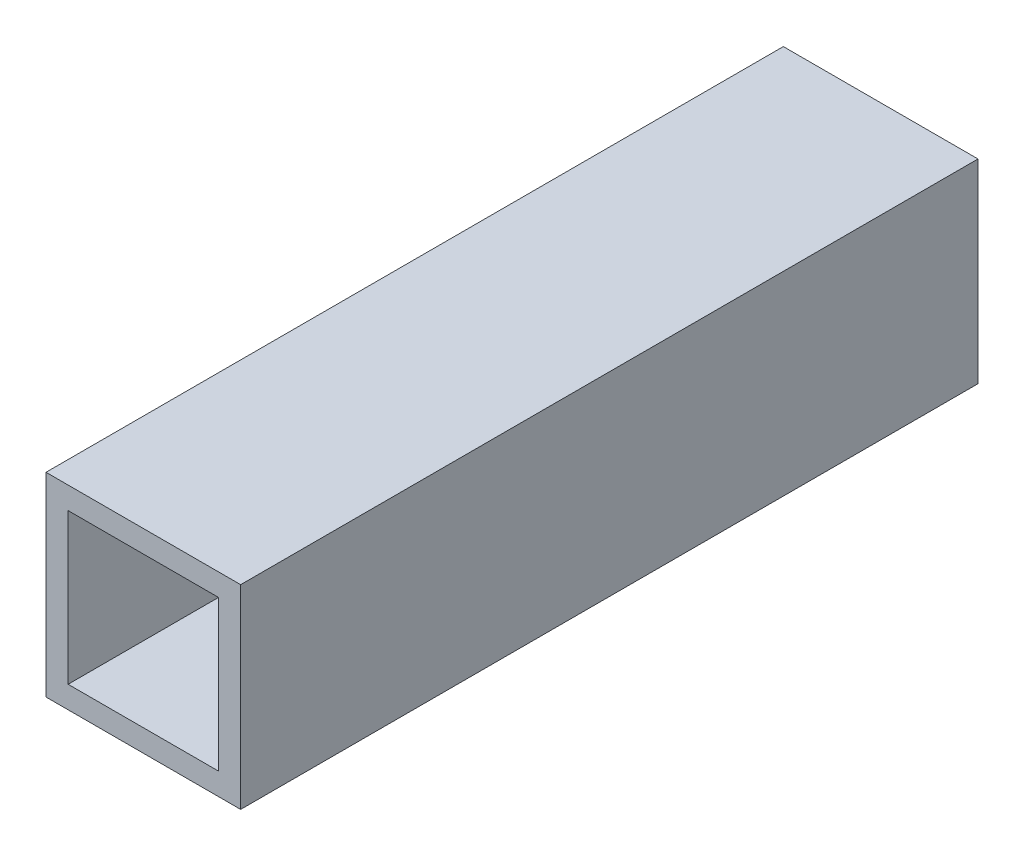
ISO-10303-21;
HEADER;
FILE_DESCRIPTION(('STEP AP214'),'2;1');
FILE_NAME('part.step','',(''),(''),'','','');
FILE_SCHEMA(('AUTOMOTIVE_DESIGN { 1 0 10303 214 1 1 1 1 }'));
ENDSEC;
DATA;
#1=APPLICATION_CONTEXT('core data for automotive mechanical design processes');
#2=APPLICATION_PROTOCOL_DEFINITION('international standard','automotive_design',2000,#1);
#3=PRODUCT_CONTEXT('',#1,'mechanical');
#4=PRODUCT('Part','Part','',(#3));
#5=PRODUCT_RELATED_PRODUCT_CATEGORY('part','',(#4));
#6=PRODUCT_DEFINITION_FORMATION('','',#4);
#7=PRODUCT_DEFINITION_CONTEXT('part definition',#1,'design');
#8=PRODUCT_DEFINITION('design','',#6,#7);
#9=PRODUCT_DEFINITION_SHAPE('','',#8);
#10=(LENGTH_UNIT() NAMED_UNIT(*) SI_UNIT(.MILLI.,.METRE.));
#11=(NAMED_UNIT(*) PLANE_ANGLE_UNIT() SI_UNIT($,.RADIAN.));
#12=(NAMED_UNIT(*) SI_UNIT($,.STERADIAN.) SOLID_ANGLE_UNIT());
#13=UNCERTAINTY_MEASURE_WITH_UNIT(LENGTH_MEASURE(1.E-05),#10,'distance_accuracy_value','');
#14=(GEOMETRIC_REPRESENTATION_CONTEXT(3) GLOBAL_UNCERTAINTY_ASSIGNED_CONTEXT((#13)) GLOBAL_UNIT_ASSIGNED_CONTEXT((#10,
#11,#12)) REPRESENTATION_CONTEXT('',''));
#15=CARTESIAN_POINT('',(0.,0.,0.));
#16=DIRECTION('',(0.,0.,1.));
#17=DIRECTION('',(1.,0.,0.));
#18=AXIS2_PLACEMENT_3D('',#15,#16,#17);
#19=CARTESIAN_POINT('',(0.,0.,50.));
#20=DIRECTION('',(0.,0.,1.));
#21=DIRECTION('',(1.,0.,0.));
#22=AXIS2_PLACEMENT_3D('',#19,#20,#21);
#23=PLANE('',#22);
#24=DIRECTION('',(0.,-1.,0.));
#25=VECTOR('',#24,1.);
#26=CARTESIAN_POINT('',(-2.3842105263158,6.33157894736842,50.));
#27=LINE('',#26,#25);
#28=CARTESIAN_POINT('',(-2.3842105263158,6.33157894736842,50.));
#29=VERTEX_POINT('',#28);
#30=CARTESIAN_POINT('',(-2.3842105263158,-6.86842105263158,50.));
#31=VERTEX_POINT('',#30);
#32=EDGE_CURVE('E136',#29,#31,#27,.T.);
#33=ORIENTED_EDGE('',*,*,#32,.T.);
#34=DIRECTION('',(1.,0.,0.));
#35=VECTOR('',#34,1.);
#36=CARTESIAN_POINT('',(-2.3842105263158,-6.86842105263158,50.));
#37=LINE('',#36,#35);
#38=CARTESIAN_POINT('',(10.8157894736842,-6.86842105263158,50.));
#39=VERTEX_POINT('',#38);
#40=EDGE_CURVE('E139',#31,#39,#37,.T.);
#41=ORIENTED_EDGE('',*,*,#40,.T.);
#42=DIRECTION('',(0.,1.,0.));
#43=VECTOR('',#42,1.);
#44=CARTESIAN_POINT('',(10.8157894736842,6.33157894736842,50.));
#45=LINE('',#44,#43);
#46=CARTESIAN_POINT('',(10.8157894736842,6.33157894736842,50.));
#47=VERTEX_POINT('',#46);
#48=EDGE_CURVE('E142',#39,#47,#45,.T.);
#49=ORIENTED_EDGE('',*,*,#48,.T.);
#50=DIRECTION('',(-1.,0.,0.));
#51=VECTOR('',#50,1.);
#52=CARTESIAN_POINT('',(-2.3842105263158,6.33157894736842,50.));
#53=LINE('',#52,#51);
#54=EDGE_CURVE('E144',#47,#29,#53,.T.);
#55=ORIENTED_EDGE('',*,*,#54,.T.);
#56=EDGE_LOOP('',(#33,#41,#49,#55));
#57=FACE_BOUND('',#56,.T.);
#58=DIRECTION('',(1.,0.,0.));
#59=VECTOR('',#58,1.);
#60=CARTESIAN_POINT('',(-0.884210526315795,-5.36842105263158,50.));
#61=LINE('',#60,#59);
#62=CARTESIAN_POINT('',(-0.884210526315795,-5.36842105263158,50.));
#63=VERTEX_POINT('',#62);
#64=CARTESIAN_POINT('',(9.3157894736842,-5.36842105263158,50.));
#65=VERTEX_POINT('',#64);
#66=EDGE_CURVE('E108',#63,#65,#61,.T.);
#67=ORIENTED_EDGE('',*,*,#66,.F.);
#68=DIRECTION('',(0.,-1.,0.));
#69=VECTOR('',#68,1.);
#70=CARTESIAN_POINT('',(-0.884210526315796,4.83157894736842,50.));
#71=LINE('',#70,#69);
#72=CARTESIAN_POINT('',(-0.884210526315796,4.83157894736842,50.));
#73=VERTEX_POINT('',#72);
#74=EDGE_CURVE('E100',#73,#63,#71,.T.);
#75=ORIENTED_EDGE('',*,*,#74,.F.);
#76=DIRECTION('',(-1.,0.,0.));
#77=VECTOR('',#76,1.);
#78=CARTESIAN_POINT('',(-0.884210526315796,4.83157894736842,50.));
#79=LINE('',#78,#77);
#80=CARTESIAN_POINT('',(9.3157894736842,4.83157894736842,50.));
#81=VERTEX_POINT('',#80);
#82=EDGE_CURVE('E122',#81,#73,#79,.T.);
#83=ORIENTED_EDGE('',*,*,#82,.F.);
#84=DIRECTION('',(0.,1.,0.));
#85=VECTOR('',#84,1.);
#86=CARTESIAN_POINT('',(9.3157894736842,4.83157894736842,50.));
#87=LINE('',#86,#85);
#88=EDGE_CURVE('E120',#65,#81,#87,.T.);
#89=ORIENTED_EDGE('',*,*,#88,.F.);
#90=EDGE_LOOP('',(#67,#75,#83,#89));
#91=FACE_BOUND('',#90,.T.);
#92=ADVANCED_FACE('F35',(#57,#91),#23,.T.);
#93=CARTESIAN_POINT('',(0.,0.,0.));
#94=DIRECTION('',(0.,0.,1.));
#95=DIRECTION('',(1.,0.,0.));
#96=AXIS2_PLACEMENT_3D('',#93,#94,#95);
#97=PLANE('',#96);
#98=DIRECTION('',(0.,-1.,0.));
#99=VECTOR('',#98,1.);
#100=CARTESIAN_POINT('',(-2.3842105263158,6.33157894736842,0.));
#101=LINE('',#100,#99);
#102=CARTESIAN_POINT('',(-2.3842105263158,6.33157894736842,0.));
#103=VERTEX_POINT('',#102);
#104=CARTESIAN_POINT('',(-2.3842105263158,-6.86842105263158,0.));
#105=VERTEX_POINT('',#104);
#106=EDGE_CURVE('E116',#103,#105,#101,.T.);
#107=ORIENTED_EDGE('',*,*,#106,.F.);
#108=DIRECTION('',(-1.,0.,0.));
#109=VECTOR('',#108,1.);
#110=CARTESIAN_POINT('',(-2.3842105263158,6.33157894736842,0.));
#111=LINE('',#110,#109);
#112=CARTESIAN_POINT('',(10.8157894736842,6.33157894736842,0.));
#113=VERTEX_POINT('',#112);
#114=EDGE_CURVE('E140',#113,#103,#111,.T.);
#115=ORIENTED_EDGE('',*,*,#114,.F.);
#116=DIRECTION('',(0.,1.,0.));
#117=VECTOR('',#116,1.);
#118=CARTESIAN_POINT('',(10.8157894736842,6.33157894736842,0.));
#119=LINE('',#118,#117);
#120=CARTESIAN_POINT('',(10.8157894736842,-6.86842105263158,0.));
#121=VERTEX_POINT('',#120);
#122=EDGE_CURVE('E151',#121,#113,#119,.T.);
#123=ORIENTED_EDGE('',*,*,#122,.F.);
#124=DIRECTION('',(1.,0.,0.));
#125=VECTOR('',#124,1.);
#126=CARTESIAN_POINT('',(-2.3842105263158,-6.86842105263158,0.));
#127=LINE('',#126,#125);
#128=EDGE_CURVE('E149',#105,#121,#127,.T.);
#129=ORIENTED_EDGE('',*,*,#128,.F.);
#130=EDGE_LOOP('',(#107,#115,#123,#129));
#131=FACE_BOUND('',#130,.T.);
#132=DIRECTION('',(0.,-1.,0.));
#133=VECTOR('',#132,1.);
#134=CARTESIAN_POINT('',(-0.884210526315796,4.83157894736842,0.));
#135=LINE('',#134,#133);
#136=CARTESIAN_POINT('',(-0.884210526315796,4.83157894736842,0.));
#137=VERTEX_POINT('',#136);
#138=CARTESIAN_POINT('',(-0.884210526315795,-5.36842105263158,0.));
#139=VERTEX_POINT('',#138);
#140=EDGE_CURVE('E58',#137,#139,#135,.T.);
#141=ORIENTED_EDGE('',*,*,#140,.T.);
#142=DIRECTION('',(1.,0.,0.));
#143=VECTOR('',#142,1.);
#144=CARTESIAN_POINT('',(-0.884210526315795,-5.36842105263158,0.));
#145=LINE('',#144,#143);
#146=CARTESIAN_POINT('',(9.3157894736842,-5.36842105263158,0.));
#147=VERTEX_POINT('',#146);
#148=EDGE_CURVE('E115',#139,#147,#145,.T.);
#149=ORIENTED_EDGE('',*,*,#148,.T.);
#150=DIRECTION('',(0.,1.,0.));
#151=VECTOR('',#150,1.);
#152=CARTESIAN_POINT('',(9.3157894736842,4.83157894736842,0.));
#153=LINE('',#152,#151);
#154=CARTESIAN_POINT('',(9.3157894736842,4.83157894736842,0.));
#155=VERTEX_POINT('',#154);
#156=EDGE_CURVE('E128',#147,#155,#153,.T.);
#157=ORIENTED_EDGE('',*,*,#156,.T.);
#158=DIRECTION('',(-1.,0.,0.));
#159=VECTOR('',#158,1.);
#160=CARTESIAN_POINT('',(-0.884210526315796,4.83157894736842,0.));
#161=LINE('',#160,#159);
#162=EDGE_CURVE('E109',#155,#137,#161,.T.);
#163=ORIENTED_EDGE('',*,*,#162,.T.);
#164=EDGE_LOOP('',(#141,#149,#157,#163));
#165=FACE_BOUND('',#164,.T.);
#166=ADVANCED_FACE('F169',(#131,#165),#97,.F.);
#167=CARTESIAN_POINT('',(-2.3842105263158,6.33157894736842,50.));
#168=DIRECTION('',(1.,0.,0.));
#169=DIRECTION('',(0.,0.,-1.));
#170=AXIS2_PLACEMENT_3D('',#167,#168,#169);
#171=PLANE('',#170);
#172=ORIENTED_EDGE('',*,*,#106,.T.);
#173=DIRECTION('',(0.,0.,-1.));
#174=VECTOR('',#173,1.);
#175=CARTESIAN_POINT('',(-2.3842105263158,-6.86842105263158,50.));
#176=LINE('',#175,#174);
#177=EDGE_CURVE('E11',#31,#105,#176,.T.);
#178=ORIENTED_EDGE('',*,*,#177,.F.);
#179=ORIENTED_EDGE('',*,*,#32,.F.);
#180=DIRECTION('',(0.,0.,-1.));
#181=VECTOR('',#180,1.);
#182=CARTESIAN_POINT('',(-2.3842105263158,6.33157894736842,50.));
#183=LINE('',#182,#181);
#184=EDGE_CURVE('E146',#29,#103,#183,.T.);
#185=ORIENTED_EDGE('',*,*,#184,.T.);
#186=EDGE_LOOP('',(#172,#178,#179,#185));
#187=FACE_BOUND('',#186,.T.);
#188=ADVANCED_FACE('F37',(#187),#171,.F.);
#189=CARTESIAN_POINT('',(-2.3842105263158,-6.86842105263158,50.));
#190=DIRECTION('',(0.,1.,0.));
#191=DIRECTION('',(0.,0.,1.));
#192=AXIS2_PLACEMENT_3D('',#189,#190,#191);
#193=PLANE('',#192);
#194=ORIENTED_EDGE('',*,*,#128,.T.);
#195=DIRECTION('',(0.,0.,-1.));
#196=VECTOR('',#195,1.);
#197=CARTESIAN_POINT('',(10.8157894736842,-6.86842105263158,50.));
#198=LINE('',#197,#196);
#199=EDGE_CURVE('E43',#39,#121,#198,.T.);
#200=ORIENTED_EDGE('',*,*,#199,.F.);
#201=ORIENTED_EDGE('',*,*,#40,.F.);
#202=ORIENTED_EDGE('',*,*,#177,.T.);
#203=EDGE_LOOP('',(#194,#200,#201,#202));
#204=FACE_BOUND('',#203,.T.);
#205=ADVANCED_FACE('F179',(#204),#193,.F.);
#206=CARTESIAN_POINT('',(10.8157894736842,6.33157894736842,50.));
#207=DIRECTION('',(-1.,0.,0.));
#208=DIRECTION('',(0.,0.,1.));
#209=AXIS2_PLACEMENT_3D('',#206,#207,#208);
#210=PLANE('',#209);
#211=ORIENTED_EDGE('',*,*,#122,.T.);
#212=DIRECTION('',(0.,0.,-1.));
#213=VECTOR('',#212,1.);
#214=CARTESIAN_POINT('',(10.8157894736842,6.33157894736842,50.));
#215=LINE('',#214,#213);
#216=EDGE_CURVE('E156',#47,#113,#215,.T.);
#217=ORIENTED_EDGE('',*,*,#216,.F.);
#218=ORIENTED_EDGE('',*,*,#48,.F.);
#219=ORIENTED_EDGE('',*,*,#199,.T.);
#220=EDGE_LOOP('',(#211,#217,#218,#219));
#221=FACE_BOUND('',#220,.T.);
#222=ADVANCED_FACE('F163',(#221),#210,.F.);
#223=CARTESIAN_POINT('',(-2.3842105263158,6.33157894736842,50.));
#224=DIRECTION('',(0.,-1.,0.));
#225=DIRECTION('',(0.,0.,-1.));
#226=AXIS2_PLACEMENT_3D('',#223,#224,#225);
#227=PLANE('',#226);
#228=ORIENTED_EDGE('',*,*,#114,.T.);
#229=ORIENTED_EDGE('',*,*,#184,.F.);
#230=ORIENTED_EDGE('',*,*,#54,.F.);
#231=ORIENTED_EDGE('',*,*,#216,.T.);
#232=EDGE_LOOP('',(#228,#229,#230,#231));
#233=FACE_BOUND('',#232,.T.);
#234=ADVANCED_FACE('F173',(#233),#227,.F.);
#235=CARTESIAN_POINT('',(-0.884210526315796,4.83157894736842,50.));
#236=DIRECTION('',(1.,0.,0.));
#237=DIRECTION('',(0.,1.,0.));
#238=AXIS2_PLACEMENT_3D('',#235,#236,#237);
#239=PLANE('',#238);
#240=ORIENTED_EDGE('',*,*,#140,.F.);
#241=DIRECTION('',(0.,0.,-1.));
#242=VECTOR('',#241,1.);
#243=CARTESIAN_POINT('',(-0.884210526315796,4.83157894736842,50.));
#244=LINE('',#243,#242);
#245=EDGE_CURVE('E104',#73,#137,#244,.T.);
#246=ORIENTED_EDGE('',*,*,#245,.F.);
#247=ORIENTED_EDGE('',*,*,#74,.T.);
#248=DIRECTION('',(0.,0.,-1.));
#249=VECTOR('',#248,1.);
#250=CARTESIAN_POINT('',(-0.884210526315795,-5.36842105263158,50.));
#251=LINE('',#250,#249);
#252=EDGE_CURVE('E103',#63,#139,#251,.T.);
#253=ORIENTED_EDGE('',*,*,#252,.T.);
#254=EDGE_LOOP('',(#240,#246,#247,#253));
#255=FACE_BOUND('',#254,.T.);
#256=ADVANCED_FACE('F102',(#255),#239,.T.);
#257=CARTESIAN_POINT('',(-0.884210526315795,-5.36842105263158,50.));
#258=DIRECTION('',(0.,1.,0.));
#259=DIRECTION('',(0.,0.,1.));
#260=AXIS2_PLACEMENT_3D('',#257,#258,#259);
#261=PLANE('',#260);
#262=ORIENTED_EDGE('',*,*,#148,.F.);
#263=ORIENTED_EDGE('',*,*,#252,.F.);
#264=ORIENTED_EDGE('',*,*,#66,.T.);
#265=DIRECTION('',(0.,0.,-1.));
#266=VECTOR('',#265,1.);
#267=CARTESIAN_POINT('',(9.3157894736842,-5.36842105263158,50.));
#268=LINE('',#267,#266);
#269=EDGE_CURVE('E117',#65,#147,#268,.T.);
#270=ORIENTED_EDGE('',*,*,#269,.T.);
#271=EDGE_LOOP('',(#262,#263,#264,#270));
#272=FACE_BOUND('',#271,.T.);
#273=ADVANCED_FACE('F112',(#272),#261,.T.);
#274=CARTESIAN_POINT('',(9.3157894736842,4.83157894736842,50.));
#275=DIRECTION('',(-1.,0.,0.));
#276=DIRECTION('',(0.,0.,1.));
#277=AXIS2_PLACEMENT_3D('',#274,#275,#276);
#278=PLANE('',#277);
#279=ORIENTED_EDGE('',*,*,#156,.F.);
#280=ORIENTED_EDGE('',*,*,#269,.F.);
#281=ORIENTED_EDGE('',*,*,#88,.T.);
#282=DIRECTION('',(0.,0.,-1.));
#283=VECTOR('',#282,1.);
#284=CARTESIAN_POINT('',(9.3157894736842,4.83157894736842,50.));
#285=LINE('',#284,#283);
#286=EDGE_CURVE('E50',#81,#155,#285,.T.);
#287=ORIENTED_EDGE('',*,*,#286,.T.);
#288=EDGE_LOOP('',(#279,#280,#281,#287));
#289=FACE_BOUND('',#288,.T.);
#290=ADVANCED_FACE('F202',(#289),#278,.T.);
#291=CARTESIAN_POINT('',(-0.884210526315796,4.83157894736842,50.));
#292=DIRECTION('',(0.,-1.,0.));
#293=DIRECTION('',(0.,0.,-1.));
#294=AXIS2_PLACEMENT_3D('',#291,#292,#293);
#295=PLANE('',#294);
#296=ORIENTED_EDGE('',*,*,#162,.F.);
#297=ORIENTED_EDGE('',*,*,#286,.F.);
#298=ORIENTED_EDGE('',*,*,#82,.T.);
#299=ORIENTED_EDGE('',*,*,#245,.T.);
#300=EDGE_LOOP('',(#296,#297,#298,#299));
#301=FACE_BOUND('',#300,.T.);
#302=ADVANCED_FACE('F206',(#301),#295,.T.);
#303=CLOSED_SHELL('',(#92,#166,#188,#205,#222,#234,#256,#273,#290,#302));
#304=MANIFOLD_SOLID_BREP('B2',#303);
#305=ADVANCED_BREP_SHAPE_REPRESENTATION('',(#18,#304),#14);
#306=SHAPE_DEFINITION_REPRESENTATION(#9,#305);
ENDSEC;
END-ISO-10303-21;
